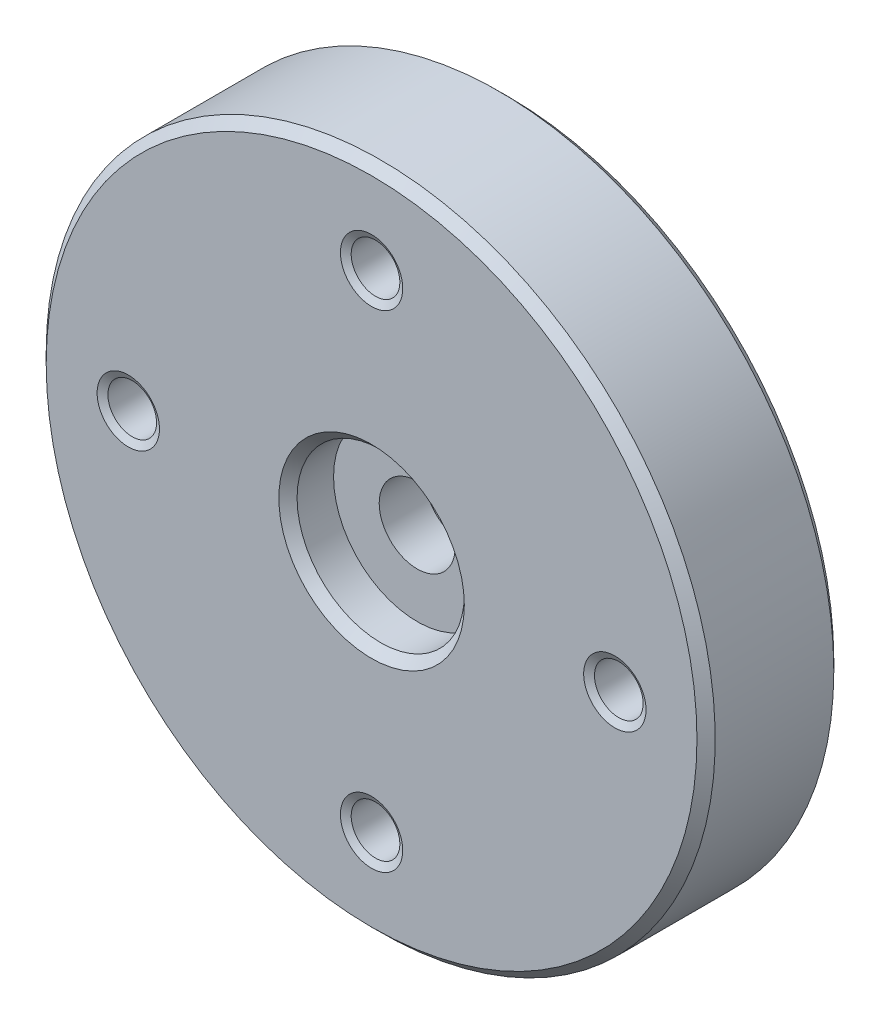
ISO-10303-21;
HEADER;
FILE_DESCRIPTION(('STEP AP214'),'2;1');
FILE_NAME('part.step','',(''),(''),'','','');
FILE_SCHEMA(('AUTOMOTIVE_DESIGN { 1 0 10303 214 1 1 1 1 }'));
ENDSEC;
DATA;
#1=APPLICATION_CONTEXT('core data for automotive mechanical design processes');
#2=APPLICATION_PROTOCOL_DEFINITION('international standard','automotive_design',2000,#1);
#3=PRODUCT_CONTEXT('',#1,'mechanical');
#4=PRODUCT('Part','Part','',(#3));
#5=PRODUCT_RELATED_PRODUCT_CATEGORY('part','',(#4));
#6=PRODUCT_DEFINITION_FORMATION('','',#4);
#7=PRODUCT_DEFINITION_CONTEXT('part definition',#1,'design');
#8=PRODUCT_DEFINITION('design','',#6,#7);
#9=PRODUCT_DEFINITION_SHAPE('','',#8);
#10=(LENGTH_UNIT() NAMED_UNIT(*) SI_UNIT(.MILLI.,.METRE.));
#11=(NAMED_UNIT(*) PLANE_ANGLE_UNIT() SI_UNIT($,.RADIAN.));
#12=(NAMED_UNIT(*) SI_UNIT($,.STERADIAN.) SOLID_ANGLE_UNIT());
#13=UNCERTAINTY_MEASURE_WITH_UNIT(LENGTH_MEASURE(1.E-05),#10,'distance_accuracy_value','');
#14=(GEOMETRIC_REPRESENTATION_CONTEXT(3) GLOBAL_UNCERTAINTY_ASSIGNED_CONTEXT((#13)) GLOBAL_UNIT_ASSIGNED_CONTEXT((#10,
#11,#12)) REPRESENTATION_CONTEXT('',''));
#15=CARTESIAN_POINT('',(0.,0.,0.));
#16=DIRECTION('',(0.,0.,1.));
#17=DIRECTION('',(1.,0.,0.));
#18=AXIS2_PLACEMENT_3D('',#15,#16,#17);
#19=CARTESIAN_POINT('',(0.,0.,-3.));
#20=DIRECTION('',(0.,0.,-1.));
#21=DIRECTION('',(-1.,0.,0.));
#22=AXIS2_PLACEMENT_3D('',#19,#20,#21);
#23=CYLINDRICAL_SURFACE('',#22,2.75);
#24=CARTESIAN_POINT('',(0.,0.,-6.7));
#25=DIRECTION('',(0.,0.,-1.));
#26=DIRECTION('',(-1.,0.,0.));
#27=AXIS2_PLACEMENT_3D('',#24,#25,#26);
#28=CIRCLE('',#27,2.75);
#29=CARTESIAN_POINT('',(-2.75,0.,-6.7));
#30=VERTEX_POINT('',#29);
#31=EDGE_CURVE('E18',#30,#30,#28,.F.);
#32=ORIENTED_EDGE('',*,*,#31,.F.);
#33=EDGE_LOOP('',(#32));
#34=FACE_BOUND('',#33,.T.);
#35=CARTESIAN_POINT('',(0.,0.,-3.));
#36=DIRECTION('',(0.,0.,-1.));
#37=DIRECTION('',(-1.,0.,0.));
#38=AXIS2_PLACEMENT_3D('',#35,#36,#37);
#39=CIRCLE('',#38,2.75);
#40=CARTESIAN_POINT('',(-2.75,0.,-3.));
#41=VERTEX_POINT('',#40);
#42=EDGE_CURVE('E80',#41,#41,#39,.T.);
#43=ORIENTED_EDGE('',*,*,#42,.F.);
#44=EDGE_LOOP('',(#43));
#45=FACE_BOUND('',#44,.T.);
#46=ADVANCED_FACE('F14',(#34,#45),#23,.F.);
#47=CARTESIAN_POINT('',(4.2504,-4.2504,-6.7));
#48=DIRECTION('',(0.,0.,-1.));
#49=DIRECTION('',(-1.,0.,0.));
#50=AXIS2_PLACEMENT_3D('',#47,#48,#49);
#51=PLANE('',#50);
#52=ORIENTED_EDGE('',*,*,#31,.T.);
#53=EDGE_LOOP('',(#52));
#54=FACE_BOUND('',#53,.T.);
#55=CARTESIAN_POINT('',(0.,0.,-6.69999999999993));
#56=DIRECTION('',(0.,0.,1.));
#57=DIRECTION('',(0.,-1.,0.));
#58=AXIS2_PLACEMENT_3D('',#55,#56,#57);
#59=CIRCLE('',#58,4.20000000000007);
#60=CARTESIAN_POINT('',(0.,-4.20000000000007,-6.69999999999993));
#61=VERTEX_POINT('',#60);
#62=EDGE_CURVE('E78',#61,#61,#59,.F.);
#63=ORIENTED_EDGE('',*,*,#62,.T.);
#64=EDGE_LOOP('',(#63));
#65=FACE_BOUND('',#64,.T.);
#66=ADVANCED_FACE('F87',(#54,#65),#51,.T.);
#67=CARTESIAN_POINT('',(2.783,-2.783,-3.));
#68=DIRECTION('',(0.,0.,-1.));
#69=DIRECTION('',(-1.,0.,0.));
#70=AXIS2_PLACEMENT_3D('',#67,#68,#69);
#71=PLANE('',#70);
#72=CARTESIAN_POINT('',(0.,0.,-3.));
#73=DIRECTION('',(0.,0.,-1.));
#74=DIRECTION('',(-1.,0.,0.));
#75=AXIS2_PLACEMENT_3D('',#72,#73,#74);
#76=CIRCLE('',#75,1.25);
#77=CARTESIAN_POINT('',(-1.25,0.,-3.));
#78=VERTEX_POINT('',#77);
#79=EDGE_CURVE('E75',#78,#78,#76,.T.);
#80=ORIENTED_EDGE('',*,*,#79,.F.);
#81=EDGE_LOOP('',(#80));
#82=FACE_BOUND('',#81,.T.);
#83=ORIENTED_EDGE('',*,*,#42,.T.);
#84=EDGE_LOOP('',(#83));
#85=FACE_BOUND('',#84,.T.);
#86=ADVANCED_FACE('F97',(#82,#85),#71,.T.);
#87=CARTESIAN_POINT('',(0.,0.,-6.7));
#88=DIRECTION('',(0.,0.,1.));
#89=DIRECTION('',(0.,-1.,0.));
#90=AXIS2_PLACEMENT_3D('',#87,#88,#89);
#91=CONICAL_SURFACE('',#90,4.2,0.785398163397448);
#92=ORIENTED_EDGE('',*,*,#62,.F.);
#93=EDGE_LOOP('',(#92));
#94=FACE_BOUND('',#93,.T.);
#95=CARTESIAN_POINT('',(0.,0.,-6.4));
#96=DIRECTION('',(0.,0.,-1.));
#97=DIRECTION('',(-1.,0.,0.));
#98=AXIS2_PLACEMENT_3D('',#95,#96,#97);
#99=CIRCLE('',#98,4.5);
#100=CARTESIAN_POINT('',(-4.5,0.,-6.4));
#101=VERTEX_POINT('',#100);
#102=EDGE_CURVE('E31',#101,#101,#99,.T.);
#103=ORIENTED_EDGE('',*,*,#102,.T.);
#104=EDGE_LOOP('',(#103));
#105=FACE_BOUND('',#104,.T.);
#106=ADVANCED_FACE('F182',(#94,#105),#91,.T.);
#107=CARTESIAN_POINT('',(0.,0.,-1.5));
#108=DIRECTION('',(0.,0.,-1.));
#109=DIRECTION('',(-1.,0.,0.));
#110=AXIS2_PLACEMENT_3D('',#107,#108,#109);
#111=CYLINDRICAL_SURFACE('',#110,1.25);
#112=ORIENTED_EDGE('',*,*,#79,.T.);
#113=EDGE_LOOP('',(#112));
#114=FACE_BOUND('',#113,.T.);
#115=CARTESIAN_POINT('',(0.,0.,-1.5));
#116=DIRECTION('',(0.,0.,-1.));
#117=DIRECTION('',(-1.,0.,0.));
#118=AXIS2_PLACEMENT_3D('',#115,#116,#117);
#119=CIRCLE('',#118,1.25);
#120=CARTESIAN_POINT('',(-1.25,0.,-1.5));
#121=VERTEX_POINT('',#120);
#122=EDGE_CURVE('E72',#121,#121,#119,.T.);
#123=ORIENTED_EDGE('',*,*,#122,.F.);
#124=EDGE_LOOP('',(#123));
#125=FACE_BOUND('',#124,.T.);
#126=ADVANCED_FACE('F179',(#114,#125),#111,.F.);
#127=CARTESIAN_POINT('',(0.,0.,-4.5));
#128=DIRECTION('',(0.,0.,-1.));
#129=DIRECTION('',(-1.,0.,0.));
#130=AXIS2_PLACEMENT_3D('',#127,#128,#129);
#131=CYLINDRICAL_SURFACE('',#130,4.5);
#132=CARTESIAN_POINT('',(0.,0.,-4.5));
#133=DIRECTION('',(0.,0.,-1.));
#134=DIRECTION('',(-1.,0.,0.));
#135=AXIS2_PLACEMENT_3D('',#132,#133,#134);
#136=CIRCLE('',#135,4.5);
#137=CARTESIAN_POINT('',(-4.5,0.,-4.5));
#138=VERTEX_POINT('',#137);
#139=EDGE_CURVE('E57',#138,#138,#136,.F.);
#140=ORIENTED_EDGE('',*,*,#139,.F.);
#141=EDGE_LOOP('',(#140));
#142=FACE_BOUND('',#141,.T.);
#143=ORIENTED_EDGE('',*,*,#102,.F.);
#144=EDGE_LOOP('',(#143));
#145=FACE_BOUND('',#144,.T.);
#146=ADVANCED_FACE('F176',(#142,#145),#131,.T.);
#147=CARTESIAN_POINT('',(-2.783,-2.783,-1.5));
#148=DIRECTION('',(0.,0.,1.));
#149=DIRECTION('',(1.,0.,0.));
#150=AXIS2_PLACEMENT_3D('',#147,#148,#149);
#151=PLANE('',#150);
#152=ORIENTED_EDGE('',*,*,#122,.T.);
#153=EDGE_LOOP('',(#152));
#154=FACE_BOUND('',#153,.T.);
#155=CARTESIAN_POINT('',(0.,0.,-1.5));
#156=DIRECTION('',(0.,0.,-1.));
#157=DIRECTION('',(-1.,0.,0.));
#158=AXIS2_PLACEMENT_3D('',#155,#156,#157);
#159=CIRCLE('',#158,2.75);
#160=CARTESIAN_POINT('',(-2.75,0.,-1.5));
#161=VERTEX_POINT('',#160);
#162=EDGE_CURVE('E53',#161,#161,#159,.T.);
#163=ORIENTED_EDGE('',*,*,#162,.F.);
#164=EDGE_LOOP('',(#163));
#165=FACE_BOUND('',#164,.T.);
#166=ADVANCED_FACE('F174',(#154,#165),#151,.T.);
#167=CARTESIAN_POINT('',(0.,8.,-4.370096189));
#168=DIRECTION('',(0.,0.,-1.));
#169=DIRECTION('',(-1.,0.,0.));
#170=AXIS2_PLACEMENT_3D('',#167,#168,#169);
#171=CONICAL_SURFACE('',#170,0.8,1.04719754975548);
#172=CARTESIAN_POINT('',(0.,8.,-4.50000000000006));
#173=DIRECTION('',(0.,0.,-1.));
#174=DIRECTION('',(-1.,0.,0.));
#175=AXIS2_PLACEMENT_3D('',#172,#173,#174);
#176=CIRCLE('',#175,1.0250000000001);
#177=CARTESIAN_POINT('',(-1.0250000000001,8.,-4.50000000000006));
#178=VERTEX_POINT('',#177);
#179=EDGE_CURVE('E69',#178,#178,#176,.F.);
#180=ORIENTED_EDGE('',*,*,#179,.F.);
#181=EDGE_LOOP('',(#180));
#182=FACE_BOUND('',#181,.T.);
#183=CARTESIAN_POINT('',(0.,8.,-4.370096189));
#184=DIRECTION('',(0.,0.,1.));
#185=DIRECTION('',(1.,0.,0.));
#186=AXIS2_PLACEMENT_3D('',#183,#184,#185);
#187=CIRCLE('',#186,0.8);
#188=CARTESIAN_POINT('',(0.8,8.,-4.370096189));
#189=VERTEX_POINT('',#188);
#190=EDGE_CURVE('E56',#189,#189,#187,.F.);
#191=ORIENTED_EDGE('',*,*,#190,.F.);
#192=EDGE_LOOP('',(#191));
#193=FACE_BOUND('',#192,.T.);
#194=ADVANCED_FACE('F170',(#182,#193),#171,.F.);
#195=CARTESIAN_POINT('',(8.,0.,-4.370096189));
#196=DIRECTION('',(0.,0.,-1.));
#197=DIRECTION('',(-1.,0.,0.));
#198=AXIS2_PLACEMENT_3D('',#195,#196,#197);
#199=CONICAL_SURFACE('',#198,0.799999999999999,1.04719754975549);
#200=CARTESIAN_POINT('',(8.,0.,-4.50000000000006));
#201=DIRECTION('',(0.,0.,-1.));
#202=DIRECTION('',(-1.,0.,0.));
#203=AXIS2_PLACEMENT_3D('',#200,#201,#202);
#204=CIRCLE('',#203,1.0250000000001);
#205=CARTESIAN_POINT('',(6.9749999999999,0.,-4.50000000000006));
#206=VERTEX_POINT('',#205);
#207=EDGE_CURVE('E66',#206,#206,#204,.F.);
#208=ORIENTED_EDGE('',*,*,#207,.F.);
#209=EDGE_LOOP('',(#208));
#210=FACE_BOUND('',#209,.T.);
#211=CARTESIAN_POINT('',(8.,0.,-4.370096189));
#212=DIRECTION('',(0.,0.,1.));
#213=DIRECTION('',(1.,0.,0.));
#214=AXIS2_PLACEMENT_3D('',#211,#212,#213);
#215=CIRCLE('',#214,0.8);
#216=CARTESIAN_POINT('',(8.8,0.,-4.370096189));
#217=VERTEX_POINT('',#216);
#218=EDGE_CURVE('E222',#217,#217,#215,.F.);
#219=ORIENTED_EDGE('',*,*,#218,.F.);
#220=EDGE_LOOP('',(#219));
#221=FACE_BOUND('',#220,.T.);
#222=ADVANCED_FACE('F166',(#210,#221),#199,.F.);
#223=CARTESIAN_POINT('',(0.,-8.,-4.370096189));
#224=DIRECTION('',(0.,0.,-1.));
#225=DIRECTION('',(-1.,0.,0.));
#226=AXIS2_PLACEMENT_3D('',#223,#224,#225);
#227=CONICAL_SURFACE('',#226,0.8,1.04719754975548);
#228=CARTESIAN_POINT('',(0.,-8.,-4.50000000000006));
#229=DIRECTION('',(0.,0.,-1.));
#230=DIRECTION('',(-1.,0.,0.));
#231=AXIS2_PLACEMENT_3D('',#228,#229,#230);
#232=CIRCLE('',#231,1.0250000000001);
#233=CARTESIAN_POINT('',(-1.0250000000001,-8.,-4.50000000000006));
#234=VERTEX_POINT('',#233);
#235=EDGE_CURVE('E63',#234,#234,#232,.F.);
#236=ORIENTED_EDGE('',*,*,#235,.F.);
#237=EDGE_LOOP('',(#236));
#238=FACE_BOUND('',#237,.T.);
#239=CARTESIAN_POINT('',(0.,-8.,-4.370096189));
#240=DIRECTION('',(0.,0.,1.));
#241=DIRECTION('',(1.,0.,0.));
#242=AXIS2_PLACEMENT_3D('',#239,#240,#241);
#243=CIRCLE('',#242,0.8);
#244=CARTESIAN_POINT('',(0.8,-8.,-4.370096189));
#245=VERTEX_POINT('',#244);
#246=EDGE_CURVE('E224',#245,#245,#243,.F.);
#247=ORIENTED_EDGE('',*,*,#246,.F.);
#248=EDGE_LOOP('',(#247));
#249=FACE_BOUND('',#248,.T.);
#250=ADVANCED_FACE('F162',(#238,#249),#227,.F.);
#251=CARTESIAN_POINT('',(-8.,0.,-4.370096189));
#252=DIRECTION('',(0.,0.,-1.));
#253=DIRECTION('',(-1.,0.,0.));
#254=AXIS2_PLACEMENT_3D('',#251,#252,#253);
#255=CONICAL_SURFACE('',#254,0.8,1.04719754975548);
#256=CARTESIAN_POINT('',(-8.,0.,-4.50000000000006));
#257=DIRECTION('',(0.,0.,-1.));
#258=DIRECTION('',(-1.,0.,0.));
#259=AXIS2_PLACEMENT_3D('',#256,#257,#258);
#260=CIRCLE('',#259,1.0250000000001);
#261=CARTESIAN_POINT('',(-9.0250000000001,0.,-4.50000000000006));
#262=VERTEX_POINT('',#261);
#263=EDGE_CURVE('E60',#262,#262,#260,.F.);
#264=ORIENTED_EDGE('',*,*,#263,.F.);
#265=EDGE_LOOP('',(#264));
#266=FACE_BOUND('',#265,.T.);
#267=CARTESIAN_POINT('',(-8.,0.,-4.370096189));
#268=DIRECTION('',(0.,0.,1.));
#269=DIRECTION('',(1.,0.,0.));
#270=AXIS2_PLACEMENT_3D('',#267,#268,#269);
#271=CIRCLE('',#270,0.799999999999999);
#272=CARTESIAN_POINT('',(-7.2,0.,-4.370096189));
#273=VERTEX_POINT('',#272);
#274=EDGE_CURVE('E52',#273,#273,#271,.F.);
#275=ORIENTED_EDGE('',*,*,#274,.F.);
#276=EDGE_LOOP('',(#275));
#277=FACE_BOUND('',#276,.T.);
#278=ADVANCED_FACE('F159',(#266,#277),#255,.F.);
#279=CARTESIAN_POINT('',(10.8284,-10.8284,-4.5));
#280=DIRECTION('',(0.,0.,-1.));
#281=DIRECTION('',(-1.,0.,0.));
#282=AXIS2_PLACEMENT_3D('',#279,#280,#281);
#283=PLANE('',#282);
#284=ORIENTED_EDGE('',*,*,#139,.T.);
#285=EDGE_LOOP('',(#284));
#286=FACE_BOUND('',#285,.T.);
#287=ORIENTED_EDGE('',*,*,#263,.T.);
#288=EDGE_LOOP('',(#287));
#289=FACE_BOUND('',#288,.T.);
#290=ORIENTED_EDGE('',*,*,#235,.T.);
#291=EDGE_LOOP('',(#290));
#292=FACE_BOUND('',#291,.T.);
#293=ORIENTED_EDGE('',*,*,#207,.T.);
#294=EDGE_LOOP('',(#293));
#295=FACE_BOUND('',#294,.T.);
#296=ORIENTED_EDGE('',*,*,#179,.T.);
#297=EDGE_LOOP('',(#296));
#298=FACE_BOUND('',#297,.T.);
#299=CARTESIAN_POINT('',(0.,0.,-4.49999999999995));
#300=DIRECTION('',(0.,0.,1.));
#301=DIRECTION('',(1.,0.,0.));
#302=AXIS2_PLACEMENT_3D('',#299,#300,#301);
#303=CIRCLE('',#302,10.7000000000001);
#304=CARTESIAN_POINT('',(10.7000000000001,0.,-4.49999999999995));
#305=VERTEX_POINT('',#304);
#306=EDGE_CURVE('E48',#305,#305,#303,.F.);
#307=ORIENTED_EDGE('',*,*,#306,.T.);
#308=EDGE_LOOP('',(#307));
#309=FACE_BOUND('',#308,.T.);
#310=ADVANCED_FACE('F157',(#286,#289,#292,#295,#298,#309),#283,.T.);
#311=CARTESIAN_POINT('',(0.,0.,-0.3));
#312=DIRECTION('',(0.,0.,-1.));
#313=DIRECTION('',(-1.,0.,0.));
#314=AXIS2_PLACEMENT_3D('',#311,#312,#313);
#315=CYLINDRICAL_SURFACE('',#314,2.75);
#316=CARTESIAN_POINT('',(0.,0.,-0.299999999999967));
#317=DIRECTION('',(0.,0.,1.));
#318=DIRECTION('',(1.,0.,0.));
#319=AXIS2_PLACEMENT_3D('',#316,#317,#318);
#320=CIRCLE('',#319,2.75);
#321=CARTESIAN_POINT('',(2.75,0.,-0.3));
#322=VERTEX_POINT('',#321);
#323=EDGE_CURVE('E51',#322,#322,#320,.F.);
#324=ORIENTED_EDGE('',*,*,#323,.F.);
#325=EDGE_LOOP('',(#324));
#326=FACE_BOUND('',#325,.T.);
#327=ORIENTED_EDGE('',*,*,#162,.T.);
#328=EDGE_LOOP('',(#327));
#329=FACE_BOUND('',#328,.T.);
#330=ADVANCED_FACE('F153',(#326,#329),#315,.F.);
#331=CARTESIAN_POINT('',(0.,8.,-4.370096189));
#332=DIRECTION('',(0.,0.,1.));
#333=DIRECTION('',(1.,0.,0.));
#334=AXIS2_PLACEMENT_3D('',#331,#332,#333);
#335=CYLINDRICAL_SURFACE('',#334,0.8);
#336=CARTESIAN_POINT('',(0.,8.,-0.129903810999976));
#337=DIRECTION('',(0.,0.,1.));
#338=DIRECTION('',(1.,0.,0.));
#339=AXIS2_PLACEMENT_3D('',#336,#337,#338);
#340=CIRCLE('',#339,0.8);
#341=CARTESIAN_POINT('',(0.8,8.,-0.129903811));
#342=VERTEX_POINT('',#341);
#343=EDGE_CURVE('E236',#342,#342,#340,.F.);
#344=ORIENTED_EDGE('',*,*,#343,.F.);
#345=EDGE_LOOP('',(#344));
#346=FACE_BOUND('',#345,.T.);
#347=ORIENTED_EDGE('',*,*,#190,.T.);
#348=EDGE_LOOP('',(#347));
#349=FACE_BOUND('',#348,.T.);
#350=ADVANCED_FACE('F149',(#346,#349),#335,.F.);
#351=CARTESIAN_POINT('',(8.,0.,-4.370096189));
#352=DIRECTION('',(0.,0.,1.));
#353=DIRECTION('',(1.,0.,0.));
#354=AXIS2_PLACEMENT_3D('',#351,#352,#353);
#355=CYLINDRICAL_SURFACE('',#354,0.8);
#356=CARTESIAN_POINT('',(8.,0.,-0.129903810999976));
#357=DIRECTION('',(0.,0.,1.));
#358=DIRECTION('',(1.,0.,0.));
#359=AXIS2_PLACEMENT_3D('',#356,#357,#358);
#360=CIRCLE('',#359,0.8);
#361=CARTESIAN_POINT('',(8.8,0.,-0.129903811));
#362=VERTEX_POINT('',#361);
#363=EDGE_CURVE('E239',#362,#362,#360,.F.);
#364=ORIENTED_EDGE('',*,*,#363,.F.);
#365=EDGE_LOOP('',(#364));
#366=FACE_BOUND('',#365,.T.);
#367=ORIENTED_EDGE('',*,*,#218,.T.);
#368=EDGE_LOOP('',(#367));
#369=FACE_BOUND('',#368,.T.);
#370=ADVANCED_FACE('F145',(#366,#369),#355,.F.);
#371=CARTESIAN_POINT('',(0.,-8.,-4.370096189));
#372=DIRECTION('',(0.,0.,1.));
#373=DIRECTION('',(1.,0.,0.));
#374=AXIS2_PLACEMENT_3D('',#371,#372,#373);
#375=CYLINDRICAL_SURFACE('',#374,0.8);
#376=CARTESIAN_POINT('',(0.,-8.,-0.129903810999976));
#377=DIRECTION('',(0.,0.,1.));
#378=DIRECTION('',(1.,0.,0.));
#379=AXIS2_PLACEMENT_3D('',#376,#377,#378);
#380=CIRCLE('',#379,0.8);
#381=CARTESIAN_POINT('',(0.8,-8.,-0.129903811));
#382=VERTEX_POINT('',#381);
#383=EDGE_CURVE('E242',#382,#382,#380,.F.);
#384=ORIENTED_EDGE('',*,*,#383,.F.);
#385=EDGE_LOOP('',(#384));
#386=FACE_BOUND('',#385,.T.);
#387=ORIENTED_EDGE('',*,*,#246,.T.);
#388=EDGE_LOOP('',(#387));
#389=FACE_BOUND('',#388,.T.);
#390=ADVANCED_FACE('F141',(#386,#389),#375,.F.);
#391=CARTESIAN_POINT('',(-8.,0.,-4.370096189));
#392=DIRECTION('',(0.,0.,1.));
#393=DIRECTION('',(1.,0.,0.));
#394=AXIS2_PLACEMENT_3D('',#391,#392,#393);
#395=CYLINDRICAL_SURFACE('',#394,0.799999999999999);
#396=CARTESIAN_POINT('',(-8.,0.,-0.129903810999976));
#397=DIRECTION('',(0.,0.,1.));
#398=DIRECTION('',(1.,0.,0.));
#399=AXIS2_PLACEMENT_3D('',#396,#397,#398);
#400=CIRCLE('',#399,0.799999999999999);
#401=CARTESIAN_POINT('',(-7.2,0.,-0.129903811));
#402=VERTEX_POINT('',#401);
#403=EDGE_CURVE('E232',#402,#402,#400,.F.);
#404=ORIENTED_EDGE('',*,*,#403,.F.);
#405=EDGE_LOOP('',(#404));
#406=FACE_BOUND('',#405,.T.);
#407=ORIENTED_EDGE('',*,*,#274,.T.);
#408=EDGE_LOOP('',(#407));
#409=FACE_BOUND('',#408,.T.);
#410=ADVANCED_FACE('F137',(#406,#409),#395,.F.);
#411=CARTESIAN_POINT('',(0.,0.,-4.5));
#412=DIRECTION('',(0.,0.,1.));
#413=DIRECTION('',(1.,0.,0.));
#414=AXIS2_PLACEMENT_3D('',#411,#412,#413);
#415=CONICAL_SURFACE('',#414,10.7,0.785398163397448);
#416=CARTESIAN_POINT('',(0.,0.,-4.2));
#417=DIRECTION('',(0.,0.,-1.));
#418=DIRECTION('',(-1.,0.,0.));
#419=AXIS2_PLACEMENT_3D('',#416,#417,#418);
#420=CIRCLE('',#419,11.);
#421=CARTESIAN_POINT('',(-11.,0.,-4.2));
#422=VERTEX_POINT('',#421);
#423=EDGE_CURVE('E47',#422,#422,#420,.T.);
#424=ORIENTED_EDGE('',*,*,#423,.T.);
#425=EDGE_LOOP('',(#424));
#426=FACE_BOUND('',#425,.T.);
#427=ORIENTED_EDGE('',*,*,#306,.F.);
#428=EDGE_LOOP('',(#427));
#429=FACE_BOUND('',#428,.T.);
#430=ADVANCED_FACE('F133',(#426,#429),#415,.T.);
#431=CARTESIAN_POINT('',(0.,0.,-0.3));
#432=DIRECTION('',(0.,0.,1.));
#433=DIRECTION('',(1.,0.,0.));
#434=AXIS2_PLACEMENT_3D('',#431,#432,#433);
#435=CONICAL_SURFACE('',#434,2.75,0.785398163397448);
#436=ORIENTED_EDGE('',*,*,#323,.T.);
#437=EDGE_LOOP('',(#436));
#438=FACE_BOUND('',#437,.T.);
#439=CARTESIAN_POINT('',(0.,0.,0.));
#440=DIRECTION('',(0.,0.,1.));
#441=DIRECTION('',(1.,0.,0.));
#442=AXIS2_PLACEMENT_3D('',#439,#440,#441);
#443=CIRCLE('',#442,3.05);
#444=CARTESIAN_POINT('',(3.05,0.,0.));
#445=VERTEX_POINT('',#444);
#446=EDGE_CURVE('E44',#445,#445,#443,.F.);
#447=ORIENTED_EDGE('',*,*,#446,.F.);
#448=EDGE_LOOP('',(#447));
#449=FACE_BOUND('',#448,.T.);
#450=ADVANCED_FACE('F129',(#438,#449),#435,.F.);
#451=CARTESIAN_POINT('',(0.,8.,-0.129903811));
#452=DIRECTION('',(0.,0.,1.));
#453=DIRECTION('',(1.,0.,0.));
#454=AXIS2_PLACEMENT_3D('',#451,#452,#453);
#455=CONICAL_SURFACE('',#454,0.8,1.04719754975548);
#456=CARTESIAN_POINT('',(0.,8.,0.));
#457=DIRECTION('',(0.,0.,1.));
#458=DIRECTION('',(1.,0.,0.));
#459=AXIS2_PLACEMENT_3D('',#456,#457,#458);
#460=CIRCLE('',#459,1.025);
#461=CARTESIAN_POINT('',(1.025,8.,0.));
#462=VERTEX_POINT('',#461);
#463=EDGE_CURVE('E41',#462,#462,#460,.F.);
#464=ORIENTED_EDGE('',*,*,#463,.F.);
#465=EDGE_LOOP('',(#464));
#466=FACE_BOUND('',#465,.T.);
#467=ORIENTED_EDGE('',*,*,#343,.T.);
#468=EDGE_LOOP('',(#467));
#469=FACE_BOUND('',#468,.T.);
#470=ADVANCED_FACE('F125',(#466,#469),#455,.F.);
#471=CARTESIAN_POINT('',(8.,0.,-0.129903811));
#472=DIRECTION('',(0.,0.,1.));
#473=DIRECTION('',(1.,0.,0.));
#474=AXIS2_PLACEMENT_3D('',#471,#472,#473);
#475=CONICAL_SURFACE('',#474,0.8,1.04719754975548);
#476=CARTESIAN_POINT('',(8.,0.,0.));
#477=DIRECTION('',(0.,0.,1.));
#478=DIRECTION('',(1.,0.,0.));
#479=AXIS2_PLACEMENT_3D('',#476,#477,#478);
#480=CIRCLE('',#479,1.025);
#481=CARTESIAN_POINT('',(9.025,0.,0.));
#482=VERTEX_POINT('',#481);
#483=EDGE_CURVE('E38',#482,#482,#480,.F.);
#484=ORIENTED_EDGE('',*,*,#483,.F.);
#485=EDGE_LOOP('',(#484));
#486=FACE_BOUND('',#485,.T.);
#487=ORIENTED_EDGE('',*,*,#363,.T.);
#488=EDGE_LOOP('',(#487));
#489=FACE_BOUND('',#488,.T.);
#490=ADVANCED_FACE('F121',(#486,#489),#475,.F.);
#491=CARTESIAN_POINT('',(0.,-8.,-0.129903811));
#492=DIRECTION('',(0.,0.,1.));
#493=DIRECTION('',(1.,0.,0.));
#494=AXIS2_PLACEMENT_3D('',#491,#492,#493);
#495=CONICAL_SURFACE('',#494,0.8,1.04719754975548);
#496=CARTESIAN_POINT('',(0.,-8.,0.));
#497=DIRECTION('',(0.,0.,1.));
#498=DIRECTION('',(1.,0.,0.));
#499=AXIS2_PLACEMENT_3D('',#496,#497,#498);
#500=CIRCLE('',#499,1.025);
#501=CARTESIAN_POINT('',(1.025,-8.,0.));
#502=VERTEX_POINT('',#501);
#503=EDGE_CURVE('E35',#502,#502,#500,.F.);
#504=ORIENTED_EDGE('',*,*,#503,.F.);
#505=EDGE_LOOP('',(#504));
#506=FACE_BOUND('',#505,.T.);
#507=ORIENTED_EDGE('',*,*,#383,.T.);
#508=EDGE_LOOP('',(#507));
#509=FACE_BOUND('',#508,.T.);
#510=ADVANCED_FACE('F117',(#506,#509),#495,.F.);
#511=CARTESIAN_POINT('',(-8.,0.,-0.129903811));
#512=DIRECTION('',(0.,0.,1.));
#513=DIRECTION('',(1.,0.,0.));
#514=AXIS2_PLACEMENT_3D('',#511,#512,#513);
#515=CONICAL_SURFACE('',#514,0.799999999999999,1.04719754975548);
#516=CARTESIAN_POINT('',(-8.,0.,0.));
#517=DIRECTION('',(0.,0.,1.));
#518=DIRECTION('',(1.,0.,0.));
#519=AXIS2_PLACEMENT_3D('',#516,#517,#518);
#520=CIRCLE('',#519,1.025);
#521=CARTESIAN_POINT('',(-6.975,0.,0.));
#522=VERTEX_POINT('',#521);
#523=EDGE_CURVE('E27',#522,#522,#520,.F.);
#524=ORIENTED_EDGE('',*,*,#523,.F.);
#525=EDGE_LOOP('',(#524));
#526=FACE_BOUND('',#525,.T.);
#527=ORIENTED_EDGE('',*,*,#403,.T.);
#528=EDGE_LOOP('',(#527));
#529=FACE_BOUND('',#528,.T.);
#530=ADVANCED_FACE('F113',(#526,#529),#515,.F.);
#531=CARTESIAN_POINT('',(0.,0.,-0.3));
#532=DIRECTION('',(0.,0.,-1.));
#533=DIRECTION('',(-1.,0.,0.));
#534=AXIS2_PLACEMENT_3D('',#531,#532,#533);
#535=CYLINDRICAL_SURFACE('',#534,11.);
#536=ORIENTED_EDGE('',*,*,#423,.F.);
#537=EDGE_LOOP('',(#536));
#538=FACE_BOUND('',#537,.T.);
#539=CARTESIAN_POINT('',(0.,0.,-0.299999999999967));
#540=DIRECTION('',(0.,0.,-1.));
#541=DIRECTION('',(-1.,0.,0.));
#542=AXIS2_PLACEMENT_3D('',#539,#540,#541);
#543=CIRCLE('',#542,11.);
#544=CARTESIAN_POINT('',(-11.,0.,-0.3));
#545=VERTEX_POINT('',#544);
#546=EDGE_CURVE('E22',#545,#545,#543,.T.);
#547=ORIENTED_EDGE('',*,*,#546,.T.);
#548=EDGE_LOOP('',(#547));
#549=FACE_BOUND('',#548,.T.);
#550=ADVANCED_FACE('F107',(#538,#549),#535,.T.);
#551=CARTESIAN_POINT('',(-10.8284,-10.8284,0.));
#552=DIRECTION('',(0.,0.,1.));
#553=DIRECTION('',(1.,0.,0.));
#554=AXIS2_PLACEMENT_3D('',#551,#552,#553);
#555=PLANE('',#554);
#556=ORIENTED_EDGE('',*,*,#523,.T.);
#557=EDGE_LOOP('',(#556));
#558=FACE_BOUND('',#557,.T.);
#559=ORIENTED_EDGE('',*,*,#503,.T.);
#560=EDGE_LOOP('',(#559));
#561=FACE_BOUND('',#560,.T.);
#562=ORIENTED_EDGE('',*,*,#483,.T.);
#563=EDGE_LOOP('',(#562));
#564=FACE_BOUND('',#563,.T.);
#565=ORIENTED_EDGE('',*,*,#463,.T.);
#566=EDGE_LOOP('',(#565));
#567=FACE_BOUND('',#566,.T.);
#568=ORIENTED_EDGE('',*,*,#446,.T.);
#569=EDGE_LOOP('',(#568));
#570=FACE_BOUND('',#569,.T.);
#571=CARTESIAN_POINT('',(0.,0.,0.));
#572=DIRECTION('',(0.,0.,-1.));
#573=DIRECTION('',(-1.,0.,0.));
#574=AXIS2_PLACEMENT_3D('',#571,#572,#573);
#575=CIRCLE('',#574,10.7);
#576=CARTESIAN_POINT('',(-10.7,0.,0.));
#577=VERTEX_POINT('',#576);
#578=EDGE_CURVE('E10',#577,#577,#575,.F.);
#579=ORIENTED_EDGE('',*,*,#578,.T.);
#580=EDGE_LOOP('',(#579));
#581=FACE_BOUND('',#580,.T.);
#582=ADVANCED_FACE('F16',(#558,#561,#564,#567,#570,#581),#555,.T.);
#583=CARTESIAN_POINT('',(0.,0.,0.));
#584=DIRECTION('',(0.,0.,-1.));
#585=DIRECTION('',(-1.,0.,0.));
#586=AXIS2_PLACEMENT_3D('',#583,#584,#585);
#587=CONICAL_SURFACE('',#586,10.7,0.785398163397448);
#588=ORIENTED_EDGE('',*,*,#578,.F.);
#589=EDGE_LOOP('',(#588));
#590=FACE_BOUND('',#589,.T.);
#591=ORIENTED_EDGE('',*,*,#546,.F.);
#592=EDGE_LOOP('',(#591));
#593=FACE_BOUND('',#592,.T.);
#594=ADVANCED_FACE('F100',(#590,#593),#587,.T.);
#595=CLOSED_SHELL('',(#46,#66,#86,#106,#126,#146,#166,#194,#222,#250,#278,#310,#330,#350,#370,
#390,#410,#430,#450,#470,#490,#510,#530,#550,#582,#594));
#596=MANIFOLD_SOLID_BREP('B1',#595);
#597=ADVANCED_BREP_SHAPE_REPRESENTATION('',(#18,#596),#14);
#598=SHAPE_DEFINITION_REPRESENTATION(#9,#597);
ENDSEC;
END-ISO-10303-21;
